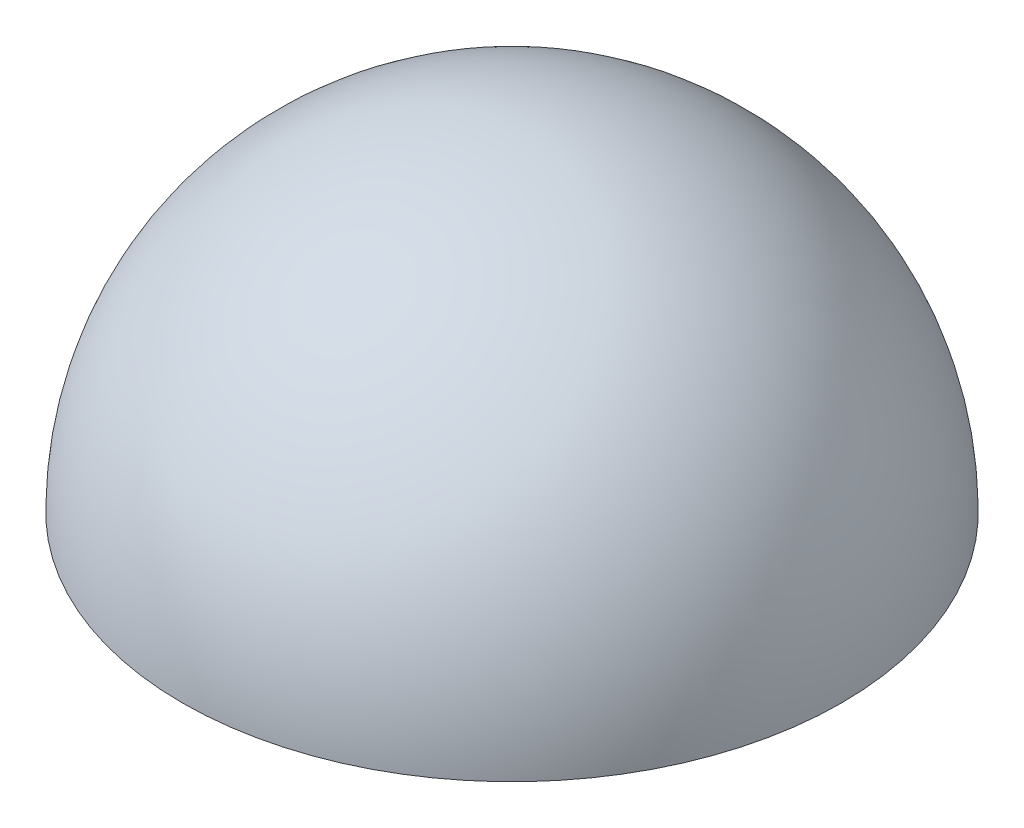
ISO-10303-21;
HEADER;
FILE_DESCRIPTION(('STEP AP214'),'2;1');
FILE_NAME('part.step','',(''),(''),'','','');
FILE_SCHEMA(('AUTOMOTIVE_DESIGN { 1 0 10303 214 1 1 1 1 }'));
ENDSEC;
DATA;
#1=APPLICATION_CONTEXT('core data for automotive mechanical design processes');
#2=APPLICATION_PROTOCOL_DEFINITION('international standard','automotive_design',2000,#1);
#3=PRODUCT_CONTEXT('',#1,'mechanical');
#4=PRODUCT('Part','Part','',(#3));
#5=PRODUCT_RELATED_PRODUCT_CATEGORY('part','',(#4));
#6=PRODUCT_DEFINITION_FORMATION('','',#4);
#7=PRODUCT_DEFINITION_CONTEXT('part definition',#1,'design');
#8=PRODUCT_DEFINITION('design','',#6,#7);
#9=PRODUCT_DEFINITION_SHAPE('','',#8);
#10=(LENGTH_UNIT() NAMED_UNIT(*) SI_UNIT(.MILLI.,.METRE.));
#11=(NAMED_UNIT(*) PLANE_ANGLE_UNIT() SI_UNIT($,.RADIAN.));
#12=(NAMED_UNIT(*) SI_UNIT($,.STERADIAN.) SOLID_ANGLE_UNIT());
#13=UNCERTAINTY_MEASURE_WITH_UNIT(LENGTH_MEASURE(1.E-05),#10,'distance_accuracy_value','');
#14=(GEOMETRIC_REPRESENTATION_CONTEXT(3) GLOBAL_UNCERTAINTY_ASSIGNED_CONTEXT((#13)) GLOBAL_UNIT_ASSIGNED_CONTEXT((#10,
#11,#12)) REPRESENTATION_CONTEXT('',''));
#15=CARTESIAN_POINT('',(0.,0.,0.));
#16=DIRECTION('',(0.,0.,1.));
#17=DIRECTION('',(1.,0.,0.));
#18=AXIS2_PLACEMENT_3D('',#15,#16,#17);
#19=CARTESIAN_POINT('',(0.,0.,0.));
#20=DIRECTION('',(0.,1.,0.));
#21=DIRECTION('',(-1.,0.,0.));
#22=AXIS2_PLACEMENT_3D('',#19,#20,#21);
#23=PLANE('',#22);
#24=CARTESIAN_POINT('',(0.,0.,0.));
#25=DIRECTION('',(0.,1.,0.));
#26=DIRECTION('',(-1.,0.,0.));
#27=AXIS2_PLACEMENT_3D('',#24,#25,#26);
#28=CIRCLE('',#27,8.3);
#29=CARTESIAN_POINT('',(-8.3,0.,0.));
#30=VERTEX_POINT('',#29);
#31=EDGE_CURVE('E11',#30,#30,#28,.T.);
#32=ORIENTED_EDGE('',*,*,#31,.F.);
#33=EDGE_LOOP('',(#32));
#34=FACE_BOUND('',#33,.T.);
#35=ADVANCED_FACE('F44',(#34),#23,.F.);
#36=CARTESIAN_POINT('',(0.,0.,0.));
#37=DIRECTION('',(0.,1.,0.));
#38=DIRECTION('',(1.,0.,0.));
#39=AXIS2_PLACEMENT_3D('',#36,#37,#38);
#40=SPHERICAL_SURFACE('',#39,8.3);
#41=ORIENTED_EDGE('',*,*,#31,.T.);
#42=EDGE_LOOP('',(#41));
#43=FACE_BOUND('',#42,.T.);
#44=ADVANCED_FACE('F55',(#43),#40,.T.);
#45=CLOSED_SHELL('',(#35,#44));
#46=MANIFOLD_SOLID_BREP('B2',#45);
#47=CARTESIAN_POINT('',(0.,0.,0.));
#48=DIRECTION('',(0.,1.,0.));
#49=DIRECTION('',(1.,0.,0.));
#50=AXIS2_PLACEMENT_3D('',#47,#48,#49);
#51=SPHERICAL_SURFACE('',#50,8.4);
#52=CARTESIAN_POINT('',(0.,0.,0.));
#53=DIRECTION('',(0.,1.,0.));
#54=DIRECTION('',(-1.,0.,0.));
#55=AXIS2_PLACEMENT_3D('',#52,#53,#54);
#56=CIRCLE('',#55,8.4);
#57=CARTESIAN_POINT('',(-8.4,0.,0.));
#58=VERTEX_POINT('',#57);
#59=EDGE_CURVE('E42',#58,#58,#56,.T.);
#60=ORIENTED_EDGE('',*,*,#59,.F.);
#61=EDGE_LOOP('',(#60));
#62=FACE_BOUND('',#61,.T.);
#63=ADVANCED_FACE('F72',(#62),#51,.F.);
#64=CARTESIAN_POINT('',(9.,0.,0.));
#65=DIRECTION('',(0.,1.,0.));
#66=DIRECTION('',(-1.,0.,0.));
#67=AXIS2_PLACEMENT_3D('',#64,#65,#66);
#68=PLANE('',#67);
#69=CARTESIAN_POINT('',(0.,0.,0.));
#70=DIRECTION('',(0.,1.,0.));
#71=DIRECTION('',(-1.,0.,0.));
#72=AXIS2_PLACEMENT_3D('',#69,#70,#71);
#73=CIRCLE('',#72,9.);
#74=CARTESIAN_POINT('',(-9.,0.,0.));
#75=VERTEX_POINT('',#74);
#76=EDGE_CURVE('E79',#75,#75,#73,.T.);
#77=ORIENTED_EDGE('',*,*,#76,.F.);
#78=EDGE_LOOP('',(#77));
#79=FACE_BOUND('',#78,.T.);
#80=ORIENTED_EDGE('',*,*,#59,.T.);
#81=EDGE_LOOP('',(#80));
#82=FACE_BOUND('',#81,.T.);
#83=ADVANCED_FACE('F82',(#79,#82),#68,.F.);
#84=CARTESIAN_POINT('',(0.,0.,0.));
#85=DIRECTION('',(0.,1.,0.));
#86=DIRECTION('',(1.,0.,0.));
#87=AXIS2_PLACEMENT_3D('',#84,#85,#86);
#88=SPHERICAL_SURFACE('',#87,9.);
#89=ORIENTED_EDGE('',*,*,#76,.T.);
#90=EDGE_LOOP('',(#89));
#91=FACE_BOUND('',#90,.T.);
#92=ADVANCED_FACE('F81',(#91),#88,.T.);
#93=CLOSED_SHELL('',(#63,#83,#92));
#94=MANIFOLD_SOLID_BREP('B6',#93);
#95=ADVANCED_BREP_SHAPE_REPRESENTATION('',(#18,#46,#94),#14);
#96=SHAPE_DEFINITION_REPRESENTATION(#9,#95);
ENDSEC;
END-ISO-10303-21;
